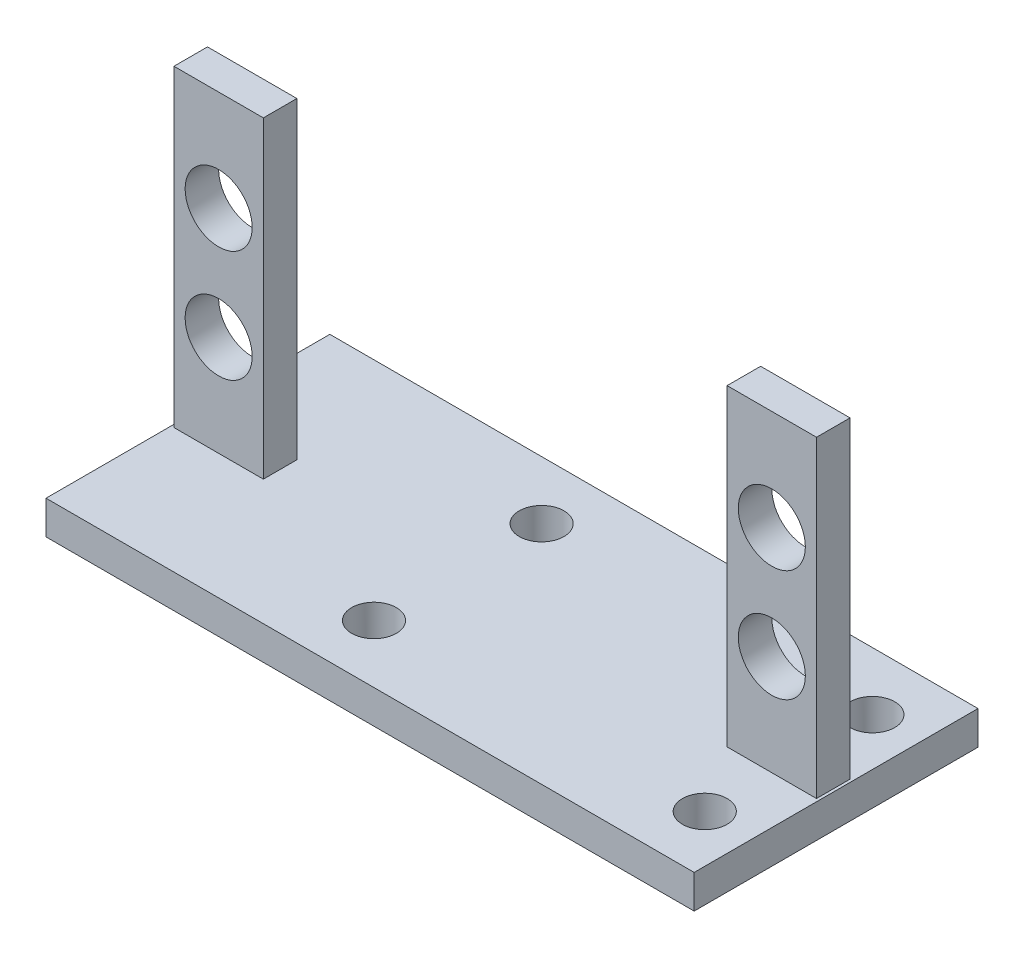
ISO-10303-21;
HEADER;
FILE_DESCRIPTION(('STEP AP214'),'2;1');
FILE_NAME('part.step','',(''),(''),'','','');
FILE_SCHEMA(('AUTOMOTIVE_DESIGN { 1 0 10303 214 1 1 1 1 }'));
ENDSEC;
DATA;
#1=APPLICATION_CONTEXT('core data for automotive mechanical design processes');
#2=APPLICATION_PROTOCOL_DEFINITION('international standard','automotive_design',2000,#1);
#3=PRODUCT_CONTEXT('',#1,'mechanical');
#4=PRODUCT('Part','Part','',(#3));
#5=PRODUCT_RELATED_PRODUCT_CATEGORY('part','',(#4));
#6=PRODUCT_DEFINITION_FORMATION('','',#4);
#7=PRODUCT_DEFINITION_CONTEXT('part definition',#1,'design');
#8=PRODUCT_DEFINITION('design','',#6,#7);
#9=PRODUCT_DEFINITION_SHAPE('','',#8);
#10=(LENGTH_UNIT() NAMED_UNIT(*) SI_UNIT(.MILLI.,.METRE.));
#11=(NAMED_UNIT(*) PLANE_ANGLE_UNIT() SI_UNIT($,.RADIAN.));
#12=(NAMED_UNIT(*) SI_UNIT($,.STERADIAN.) SOLID_ANGLE_UNIT());
#13=UNCERTAINTY_MEASURE_WITH_UNIT(LENGTH_MEASURE(1.E-05),#10,'distance_accuracy_value','');
#14=(GEOMETRIC_REPRESENTATION_CONTEXT(3) GLOBAL_UNCERTAINTY_ASSIGNED_CONTEXT((#13)) GLOBAL_UNIT_ASSIGNED_CONTEXT((#10,
#11,#12)) REPRESENTATION_CONTEXT('',''));
#15=CARTESIAN_POINT('',(0.,0.,0.));
#16=DIRECTION('',(0.,0.,1.));
#17=DIRECTION('',(1.,0.,0.));
#18=AXIS2_PLACEMENT_3D('',#15,#16,#17);
#19=CARTESIAN_POINT('',(-29.,3.,-12.7));
#20=DIRECTION('',(0.,0.,1.));
#21=DIRECTION('',(1.,0.,0.));
#22=AXIS2_PLACEMENT_3D('',#19,#20,#21);
#23=PLANE('',#22);
#24=DIRECTION('',(0.,-1.,0.));
#25=VECTOR('',#24,1.);
#26=CARTESIAN_POINT('',(-29.,3.,-12.7));
#27=LINE('',#26,#25);
#28=CARTESIAN_POINT('',(-29.,3.,-12.7));
#29=VERTEX_POINT('',#28);
#30=CARTESIAN_POINT('',(-29.,0.,-12.7));
#31=VERTEX_POINT('',#30);
#32=EDGE_CURVE('E48',#29,#31,#27,.T.);
#33=ORIENTED_EDGE('',*,*,#32,.F.);
#34=DIRECTION('',(-1.,0.,0.));
#35=VECTOR('',#34,1.);
#36=CARTESIAN_POINT('',(-29.,3.,-12.7));
#37=LINE('',#36,#35);
#38=CARTESIAN_POINT('',(29.,3.,-12.7));
#39=VERTEX_POINT('',#38);
#40=EDGE_CURVE('E208',#39,#29,#37,.T.);
#41=ORIENTED_EDGE('',*,*,#40,.F.);
#42=DIRECTION('',(0.,-1.,0.));
#43=VECTOR('',#42,1.);
#44=CARTESIAN_POINT('',(29.,3.,-12.7));
#45=LINE('',#44,#43);
#46=CARTESIAN_POINT('',(29.,0.,-12.7));
#47=VERTEX_POINT('',#46);
#48=EDGE_CURVE('E11',#39,#47,#45,.T.);
#49=ORIENTED_EDGE('',*,*,#48,.T.);
#50=DIRECTION('',(-1.,0.,0.));
#51=VECTOR('',#50,1.);
#52=CARTESIAN_POINT('',(-29.,0.,-12.7));
#53=LINE('',#52,#51);
#54=EDGE_CURVE('E222',#47,#31,#53,.T.);
#55=ORIENTED_EDGE('',*,*,#54,.T.);
#56=EDGE_LOOP('',(#33,#41,#49,#55));
#57=FACE_BOUND('',#56,.T.);
#58=ADVANCED_FACE('F38',(#57),#23,.F.);
#59=CARTESIAN_POINT('',(0.,3.,0.));
#60=DIRECTION('',(0.,1.,0.));
#61=DIRECTION('',(0.,0.,1.));
#62=AXIS2_PLACEMENT_3D('',#59,#60,#61);
#63=PLANE('',#62);
#64=ORIENTED_EDGE('',*,*,#40,.T.);
#65=DIRECTION('',(0.,0.,1.));
#66=VECTOR('',#65,1.);
#67=CARTESIAN_POINT('',(-29.,3.,-12.7));
#68=LINE('',#67,#66);
#69=CARTESIAN_POINT('',(-29.,3.,12.7));
#70=VERTEX_POINT('',#69);
#71=EDGE_CURVE('E212',#29,#70,#68,.T.);
#72=ORIENTED_EDGE('',*,*,#71,.T.);
#73=DIRECTION('',(1.,0.,0.));
#74=VECTOR('',#73,1.);
#75=CARTESIAN_POINT('',(-29.,3.,12.7));
#76=LINE('',#75,#74);
#77=CARTESIAN_POINT('',(29.,3.,12.7));
#78=VERTEX_POINT('',#77);
#79=EDGE_CURVE('E215',#70,#78,#76,.T.);
#80=ORIENTED_EDGE('',*,*,#79,.T.);
#81=DIRECTION('',(0.,0.,-1.));
#82=VECTOR('',#81,1.);
#83=CARTESIAN_POINT('',(29.,3.,-12.7));
#84=LINE('',#83,#82);
#85=EDGE_CURVE('E204',#78,#39,#84,.T.);
#86=ORIENTED_EDGE('',*,*,#85,.T.);
#87=EDGE_LOOP('',(#64,#72,#80,#86));
#88=FACE_BOUND('',#87,.T.);
#89=CARTESIAN_POINT('',(-4.85,3.,7.5));
#90=DIRECTION('',(0.,1.,0.));
#91=DIRECTION('',(0.,0.,-1.));
#92=AXIS2_PLACEMENT_3D('',#89,#90,#91);
#93=CIRCLE('',#92,2.);
#94=CARTESIAN_POINT('',(-4.85,3.,5.5));
#95=VERTEX_POINT('',#94);
#96=EDGE_CURVE('E389',#95,#95,#93,.T.);
#97=ORIENTED_EDGE('',*,*,#96,.F.);
#98=EDGE_LOOP('',(#97));
#99=FACE_BOUND('',#98,.T.);
#100=CARTESIAN_POINT('',(24.75,3.,-7.5));
#101=DIRECTION('',(0.,1.,0.));
#102=DIRECTION('',(0.,0.,-1.));
#103=AXIS2_PLACEMENT_3D('',#100,#101,#102);
#104=CIRCLE('',#103,2.);
#105=CARTESIAN_POINT('',(24.75,3.,-9.5));
#106=VERTEX_POINT('',#105);
#107=EDGE_CURVE('E393',#106,#106,#104,.T.);
#108=ORIENTED_EDGE('',*,*,#107,.F.);
#109=EDGE_LOOP('',(#108));
#110=FACE_BOUND('',#109,.T.);
#111=CARTESIAN_POINT('',(24.75,3.,7.5));
#112=DIRECTION('',(0.,1.,0.));
#113=DIRECTION('',(0.,0.,1.));
#114=AXIS2_PLACEMENT_3D('',#111,#112,#113);
#115=CIRCLE('',#114,2.);
#116=CARTESIAN_POINT('',(24.75,3.,9.5));
#117=VERTEX_POINT('',#116);
#118=EDGE_CURVE('E397',#117,#117,#115,.T.);
#119=ORIENTED_EDGE('',*,*,#118,.F.);
#120=EDGE_LOOP('',(#119));
#121=FACE_BOUND('',#120,.T.);
#122=CARTESIAN_POINT('',(-4.85,3.,-7.5));
#123=DIRECTION('',(0.,1.,0.));
#124=DIRECTION('',(0.,0.,1.));
#125=AXIS2_PLACEMENT_3D('',#122,#123,#124);
#126=CIRCLE('',#125,2.);
#127=CARTESIAN_POINT('',(-4.85,3.,-5.5));
#128=VERTEX_POINT('',#127);
#129=EDGE_CURVE('E265',#128,#128,#126,.T.);
#130=ORIENTED_EDGE('',*,*,#129,.F.);
#131=EDGE_LOOP('',(#130));
#132=FACE_BOUND('',#131,.T.);
#133=DIRECTION('',(-1.,0.,0.));
#134=VECTOR('',#133,1.);
#135=CARTESIAN_POINT('',(-28.75,3.,-1.5));
#136=LINE('',#135,#134);
#137=CARTESIAN_POINT('',(-20.75,3.,-1.5));
#138=VERTEX_POINT('',#137);
#139=CARTESIAN_POINT('',(-28.75,3.,-1.5));
#140=VERTEX_POINT('',#139);
#141=EDGE_CURVE('E164',#138,#140,#136,.T.);
#142=ORIENTED_EDGE('',*,*,#141,.F.);
#143=DIRECTION('',(0.,0.,-1.));
#144=VECTOR('',#143,1.);
#145=CARTESIAN_POINT('',(-20.75,3.,-1.5));
#146=LINE('',#145,#144);
#147=CARTESIAN_POINT('',(-20.75,3.,1.5));
#148=VERTEX_POINT('',#147);
#149=EDGE_CURVE('E159',#148,#138,#146,.T.);
#150=ORIENTED_EDGE('',*,*,#149,.F.);
#151=DIRECTION('',(1.,0.,0.));
#152=VECTOR('',#151,1.);
#153=CARTESIAN_POINT('',(-20.75,3.,1.5));
#154=LINE('',#153,#152);
#155=CARTESIAN_POINT('',(-28.75,3.,1.5));
#156=VERTEX_POINT('',#155);
#157=EDGE_CURVE('E174',#156,#148,#154,.T.);
#158=ORIENTED_EDGE('',*,*,#157,.F.);
#159=DIRECTION('',(0.,0.,1.));
#160=VECTOR('',#159,1.);
#161=CARTESIAN_POINT('',(-28.75,3.,1.5));
#162=LINE('',#161,#160);
#163=EDGE_CURVE('E186',#140,#156,#162,.T.);
#164=ORIENTED_EDGE('',*,*,#163,.F.);
#165=EDGE_LOOP('',(#142,#150,#158,#164));
#166=FACE_BOUND('',#165,.T.);
#167=DIRECTION('',(0.,0.,-1.));
#168=VECTOR('',#167,1.);
#169=CARTESIAN_POINT('',(28.75,3.,1.5));
#170=LINE('',#169,#168);
#171=CARTESIAN_POINT('',(28.75,3.,1.5));
#172=VERTEX_POINT('',#171);
#173=CARTESIAN_POINT('',(28.75,3.,-1.5));
#174=VERTEX_POINT('',#173);
#175=EDGE_CURVE('E404',#172,#174,#170,.T.);
#176=ORIENTED_EDGE('',*,*,#175,.F.);
#177=DIRECTION('',(1.,0.,0.));
#178=VECTOR('',#177,1.);
#179=CARTESIAN_POINT('',(20.75,3.,1.5));
#180=LINE('',#179,#178);
#181=CARTESIAN_POINT('',(20.75,3.,1.5));
#182=VERTEX_POINT('',#181);
#183=EDGE_CURVE('E156',#182,#172,#180,.T.);
#184=ORIENTED_EDGE('',*,*,#183,.F.);
#185=DIRECTION('',(0.,0.,1.));
#186=VECTOR('',#185,1.);
#187=CARTESIAN_POINT('',(20.75,3.,-1.5));
#188=LINE('',#187,#186);
#189=CARTESIAN_POINT('',(20.75,3.,-1.5));
#190=VERTEX_POINT('',#189);
#191=EDGE_CURVE('E152',#190,#182,#188,.T.);
#192=ORIENTED_EDGE('',*,*,#191,.F.);
#193=DIRECTION('',(-1.,0.,0.));
#194=VECTOR('',#193,1.);
#195=CARTESIAN_POINT('',(28.75,3.,-1.5));
#196=LINE('',#195,#194);
#197=EDGE_CURVE('E406',#174,#190,#196,.T.);
#198=ORIENTED_EDGE('',*,*,#197,.F.);
#199=EDGE_LOOP('',(#176,#184,#192,#198));
#200=FACE_BOUND('',#199,.T.);
#201=ADVANCED_FACE('F294',(#88,#99,#110,#121,#132,#166,#200),#63,.T.);
#202=CARTESIAN_POINT('',(29.,3.,-12.7));
#203=DIRECTION('',(-1.,0.,0.));
#204=DIRECTION('',(0.,0.,1.));
#205=AXIS2_PLACEMENT_3D('',#202,#203,#204);
#206=PLANE('',#205);
#207=DIRECTION('',(0.,0.,-1.));
#208=VECTOR('',#207,1.);
#209=CARTESIAN_POINT('',(29.,0.,-12.7));
#210=LINE('',#209,#208);
#211=CARTESIAN_POINT('',(29.,0.,12.7));
#212=VERTEX_POINT('',#211);
#213=EDGE_CURVE('E203',#212,#47,#210,.T.);
#214=ORIENTED_EDGE('',*,*,#213,.T.);
#215=ORIENTED_EDGE('',*,*,#48,.F.);
#216=ORIENTED_EDGE('',*,*,#85,.F.);
#217=DIRECTION('',(0.,-1.,0.));
#218=VECTOR('',#217,1.);
#219=CARTESIAN_POINT('',(29.,3.,12.7));
#220=LINE('',#219,#218);
#221=EDGE_CURVE('E218',#78,#212,#220,.T.);
#222=ORIENTED_EDGE('',*,*,#221,.T.);
#223=EDGE_LOOP('',(#214,#215,#216,#222));
#224=FACE_BOUND('',#223,.T.);
#225=ADVANCED_FACE('F40',(#224),#206,.F.);
#226=CARTESIAN_POINT('',(-29.,3.,-12.7));
#227=DIRECTION('',(1.,0.,0.));
#228=DIRECTION('',(0.,0.,-1.));
#229=AXIS2_PLACEMENT_3D('',#226,#227,#228);
#230=PLANE('',#229);
#231=DIRECTION('',(0.,0.,1.));
#232=VECTOR('',#231,1.);
#233=CARTESIAN_POINT('',(-29.,0.,-12.7));
#234=LINE('',#233,#232);
#235=CARTESIAN_POINT('',(-29.,0.,12.7));
#236=VERTEX_POINT('',#235);
#237=EDGE_CURVE('E225',#31,#236,#234,.T.);
#238=ORIENTED_EDGE('',*,*,#237,.T.);
#239=DIRECTION('',(0.,-1.,0.));
#240=VECTOR('',#239,1.);
#241=CARTESIAN_POINT('',(-29.,3.,12.7));
#242=LINE('',#241,#240);
#243=EDGE_CURVE('E233',#70,#236,#242,.T.);
#244=ORIENTED_EDGE('',*,*,#243,.F.);
#245=ORIENTED_EDGE('',*,*,#71,.F.);
#246=ORIENTED_EDGE('',*,*,#32,.T.);
#247=EDGE_LOOP('',(#238,#244,#245,#246));
#248=FACE_BOUND('',#247,.T.);
#249=ADVANCED_FACE('F303',(#248),#230,.F.);
#250=CARTESIAN_POINT('',(-29.,3.,12.7));
#251=DIRECTION('',(0.,0.,-1.));
#252=DIRECTION('',(-1.,0.,0.));
#253=AXIS2_PLACEMENT_3D('',#250,#251,#252);
#254=PLANE('',#253);
#255=DIRECTION('',(1.,0.,0.));
#256=VECTOR('',#255,1.);
#257=CARTESIAN_POINT('',(-29.,0.,12.7));
#258=LINE('',#257,#256);
#259=EDGE_CURVE('E209',#236,#212,#258,.T.);
#260=ORIENTED_EDGE('',*,*,#259,.T.);
#261=ORIENTED_EDGE('',*,*,#221,.F.);
#262=ORIENTED_EDGE('',*,*,#79,.F.);
#263=ORIENTED_EDGE('',*,*,#243,.T.);
#264=EDGE_LOOP('',(#260,#261,#262,#263));
#265=FACE_BOUND('',#264,.T.);
#266=ADVANCED_FACE('F306',(#265),#254,.F.);
#267=CARTESIAN_POINT('',(0.,0.,0.));
#268=DIRECTION('',(0.,1.,0.));
#269=DIRECTION('',(0.,0.,1.));
#270=AXIS2_PLACEMENT_3D('',#267,#268,#269);
#271=PLANE('',#270);
#272=CARTESIAN_POINT('',(-4.85,0.,7.5));
#273=DIRECTION('',(0.,1.,0.));
#274=DIRECTION('',(0.,0.,1.));
#275=AXIS2_PLACEMENT_3D('',#272,#273,#274);
#276=CIRCLE('',#275,2.);
#277=CARTESIAN_POINT('',(-4.85,0.,9.5));
#278=VERTEX_POINT('',#277);
#279=EDGE_CURVE('E42',#278,#278,#276,.T.);
#280=ORIENTED_EDGE('',*,*,#279,.T.);
#281=EDGE_LOOP('',(#280));
#282=FACE_BOUND('',#281,.T.);
#283=CARTESIAN_POINT('',(24.75,0.,-7.5));
#284=DIRECTION('',(0.,1.,0.));
#285=DIRECTION('',(0.,0.,1.));
#286=AXIS2_PLACEMENT_3D('',#283,#284,#285);
#287=CIRCLE('',#286,2.);
#288=CARTESIAN_POINT('',(24.75,0.,-5.5));
#289=VERTEX_POINT('',#288);
#290=EDGE_CURVE('E268',#289,#289,#287,.T.);
#291=ORIENTED_EDGE('',*,*,#290,.T.);
#292=EDGE_LOOP('',(#291));
#293=FACE_BOUND('',#292,.T.);
#294=CARTESIAN_POINT('',(24.75,0.,7.5));
#295=DIRECTION('',(0.,1.,0.));
#296=DIRECTION('',(0.,0.,1.));
#297=AXIS2_PLACEMENT_3D('',#294,#295,#296);
#298=CIRCLE('',#297,2.);
#299=CARTESIAN_POINT('',(24.75,0.,9.5));
#300=VERTEX_POINT('',#299);
#301=EDGE_CURVE('E264',#300,#300,#298,.T.);
#302=ORIENTED_EDGE('',*,*,#301,.T.);
#303=EDGE_LOOP('',(#302));
#304=FACE_BOUND('',#303,.T.);
#305=CARTESIAN_POINT('',(-4.85,0.,-7.5));
#306=DIRECTION('',(0.,1.,0.));
#307=DIRECTION('',(0.,0.,1.));
#308=AXIS2_PLACEMENT_3D('',#305,#306,#307);
#309=CIRCLE('',#308,2.);
#310=CARTESIAN_POINT('',(-4.85,0.,-5.5));
#311=VERTEX_POINT('',#310);
#312=EDGE_CURVE('E260',#311,#311,#309,.T.);
#313=ORIENTED_EDGE('',*,*,#312,.T.);
#314=EDGE_LOOP('',(#313));
#315=FACE_BOUND('',#314,.T.);
#316=ORIENTED_EDGE('',*,*,#213,.F.);
#317=ORIENTED_EDGE('',*,*,#259,.F.);
#318=ORIENTED_EDGE('',*,*,#237,.F.);
#319=ORIENTED_EDGE('',*,*,#54,.F.);
#320=EDGE_LOOP('',(#316,#317,#318,#319));
#321=FACE_BOUND('',#320,.T.);
#322=ADVANCED_FACE('F277',(#282,#293,#304,#315,#321),#271,.F.);
#323=CARTESIAN_POINT('',(-20.75,31.,-1.5));
#324=DIRECTION('',(-1.,0.,0.));
#325=DIRECTION('',(0.,0.,1.));
#326=AXIS2_PLACEMENT_3D('',#323,#324,#325);
#327=PLANE('',#326);
#328=ORIENTED_EDGE('',*,*,#149,.T.);
#329=DIRECTION('',(0.,-1.,0.));
#330=VECTOR('',#329,1.);
#331=CARTESIAN_POINT('',(-20.75,31.,-1.5));
#332=LINE('',#331,#330);
#333=CARTESIAN_POINT('',(-20.75,31.,-1.5));
#334=VERTEX_POINT('',#333);
#335=EDGE_CURVE('E200',#334,#138,#332,.T.);
#336=ORIENTED_EDGE('',*,*,#335,.F.);
#337=DIRECTION('',(0.,0.,-1.));
#338=VECTOR('',#337,1.);
#339=CARTESIAN_POINT('',(-20.75,31.,-1.5));
#340=LINE('',#339,#338);
#341=CARTESIAN_POINT('',(-20.75,31.,1.5));
#342=VERTEX_POINT('',#341);
#343=EDGE_CURVE('E169',#342,#334,#340,.T.);
#344=ORIENTED_EDGE('',*,*,#343,.F.);
#345=DIRECTION('',(0.,-1.,0.));
#346=VECTOR('',#345,1.);
#347=CARTESIAN_POINT('',(-20.75,31.,1.5));
#348=LINE('',#347,#346);
#349=EDGE_CURVE('E182',#342,#148,#348,.T.);
#350=ORIENTED_EDGE('',*,*,#349,.T.);
#351=EDGE_LOOP('',(#328,#336,#344,#350));
#352=FACE_BOUND('',#351,.T.);
#353=ADVANCED_FACE('F312',(#352),#327,.F.);
#354=CARTESIAN_POINT('',(-28.75,31.,-1.5));
#355=DIRECTION('',(0.,0.,1.));
#356=DIRECTION('',(1.,0.,0.));
#357=AXIS2_PLACEMENT_3D('',#354,#355,#356);
#358=PLANE('',#357);
#359=CARTESIAN_POINT('',(-24.75,22.,-1.5));
#360=DIRECTION('',(0.,0.,1.));
#361=DIRECTION('',(1.,0.,0.));
#362=AXIS2_PLACEMENT_3D('',#359,#360,#361);
#363=CIRCLE('',#362,3.);
#364=CARTESIAN_POINT('',(-21.75,22.,-1.5));
#365=VERTEX_POINT('',#364);
#366=EDGE_CURVE('E259',#365,#365,#363,.T.);
#367=ORIENTED_EDGE('',*,*,#366,.T.);
#368=EDGE_LOOP('',(#367));
#369=FACE_BOUND('',#368,.T.);
#370=CARTESIAN_POINT('',(-24.75,12.,-1.5));
#371=DIRECTION('',(0.,0.,1.));
#372=DIRECTION('',(1.,0.,0.));
#373=AXIS2_PLACEMENT_3D('',#370,#371,#372);
#374=CIRCLE('',#373,3.);
#375=CARTESIAN_POINT('',(-21.75,12.,-1.5));
#376=VERTEX_POINT('',#375);
#377=EDGE_CURVE('E254',#376,#376,#374,.T.);
#378=ORIENTED_EDGE('',*,*,#377,.T.);
#379=EDGE_LOOP('',(#378));
#380=FACE_BOUND('',#379,.T.);
#381=ORIENTED_EDGE('',*,*,#141,.T.);
#382=DIRECTION('',(0.,-1.,0.));
#383=VECTOR('',#382,1.);
#384=CARTESIAN_POINT('',(-28.75,31.,-1.5));
#385=LINE('',#384,#383);
#386=CARTESIAN_POINT('',(-28.75,31.,-1.5));
#387=VERTEX_POINT('',#386);
#388=EDGE_CURVE('E196',#387,#140,#385,.T.);
#389=ORIENTED_EDGE('',*,*,#388,.F.);
#390=DIRECTION('',(-1.,0.,0.));
#391=VECTOR('',#390,1.);
#392=CARTESIAN_POINT('',(-28.75,31.,-1.5));
#393=LINE('',#392,#391);
#394=EDGE_CURVE('E173',#334,#387,#393,.T.);
#395=ORIENTED_EDGE('',*,*,#394,.F.);
#396=ORIENTED_EDGE('',*,*,#335,.T.);
#397=EDGE_LOOP('',(#381,#389,#395,#396));
#398=FACE_BOUND('',#397,.T.);
#399=ADVANCED_FACE('F316',(#369,#380,#398),#358,.F.);
#400=CARTESIAN_POINT('',(-28.75,31.,1.5));
#401=DIRECTION('',(1.,0.,0.));
#402=DIRECTION('',(0.,0.,-1.));
#403=AXIS2_PLACEMENT_3D('',#400,#401,#402);
#404=PLANE('',#403);
#405=ORIENTED_EDGE('',*,*,#163,.T.);
#406=DIRECTION('',(0.,-1.,0.));
#407=VECTOR('',#406,1.);
#408=CARTESIAN_POINT('',(-28.75,31.,1.5));
#409=LINE('',#408,#407);
#410=CARTESIAN_POINT('',(-28.75,31.,1.5));
#411=VERTEX_POINT('',#410);
#412=EDGE_CURVE('E64',#411,#156,#409,.T.);
#413=ORIENTED_EDGE('',*,*,#412,.F.);
#414=DIRECTION('',(0.,0.,1.));
#415=VECTOR('',#414,1.);
#416=CARTESIAN_POINT('',(-28.75,31.,1.5));
#417=LINE('',#416,#415);
#418=EDGE_CURVE('E177',#387,#411,#417,.T.);
#419=ORIENTED_EDGE('',*,*,#418,.F.);
#420=ORIENTED_EDGE('',*,*,#388,.T.);
#421=EDGE_LOOP('',(#405,#413,#419,#420));
#422=FACE_BOUND('',#421,.T.);
#423=ADVANCED_FACE('F320',(#422),#404,.F.);
#424=CARTESIAN_POINT('',(-20.75,31.,1.5));
#425=DIRECTION('',(0.,0.,-1.));
#426=DIRECTION('',(-1.,0.,0.));
#427=AXIS2_PLACEMENT_3D('',#424,#425,#426);
#428=PLANE('',#427);
#429=CARTESIAN_POINT('',(-24.75,22.,1.5));
#430=DIRECTION('',(0.,0.,-1.));
#431=DIRECTION('',(-1.,0.,0.));
#432=AXIS2_PLACEMENT_3D('',#429,#430,#431);
#433=CIRCLE('',#432,3.);
#434=CARTESIAN_POINT('',(-27.75,22.,1.5));
#435=VERTEX_POINT('',#434);
#436=EDGE_CURVE('E255',#435,#435,#433,.T.);
#437=ORIENTED_EDGE('',*,*,#436,.T.);
#438=EDGE_LOOP('',(#437));
#439=FACE_BOUND('',#438,.T.);
#440=CARTESIAN_POINT('',(-24.75,12.,1.5));
#441=DIRECTION('',(0.,0.,-1.));
#442=DIRECTION('',(-1.,0.,0.));
#443=AXIS2_PLACEMENT_3D('',#440,#441,#442);
#444=CIRCLE('',#443,3.);
#445=CARTESIAN_POINT('',(-27.75,12.,1.5));
#446=VERTEX_POINT('',#445);
#447=EDGE_CURVE('E250',#446,#446,#444,.T.);
#448=ORIENTED_EDGE('',*,*,#447,.T.);
#449=EDGE_LOOP('',(#448));
#450=FACE_BOUND('',#449,.T.);
#451=ORIENTED_EDGE('',*,*,#157,.T.);
#452=ORIENTED_EDGE('',*,*,#349,.F.);
#453=DIRECTION('',(1.,0.,0.));
#454=VECTOR('',#453,1.);
#455=CARTESIAN_POINT('',(-20.75,31.,1.5));
#456=LINE('',#455,#454);
#457=EDGE_CURVE('E180',#411,#342,#456,.T.);
#458=ORIENTED_EDGE('',*,*,#457,.F.);
#459=ORIENTED_EDGE('',*,*,#412,.T.);
#460=EDGE_LOOP('',(#451,#452,#458,#459));
#461=FACE_BOUND('',#460,.T.);
#462=ADVANCED_FACE('F324',(#439,#450,#461),#428,.F.);
#463=CARTESIAN_POINT('',(0.,31.,0.));
#464=DIRECTION('',(0.,-1.,0.));
#465=DIRECTION('',(0.,0.,-1.));
#466=AXIS2_PLACEMENT_3D('',#463,#464,#465);
#467=PLANE('',#466);
#468=ORIENTED_EDGE('',*,*,#343,.T.);
#469=ORIENTED_EDGE('',*,*,#394,.T.);
#470=ORIENTED_EDGE('',*,*,#418,.T.);
#471=ORIENTED_EDGE('',*,*,#457,.T.);
#472=EDGE_LOOP('',(#468,#469,#470,#471));
#473=FACE_BOUND('',#472,.T.);
#474=ADVANCED_FACE('F328',(#473),#467,.F.);
#475=CARTESIAN_POINT('',(20.75,31.,1.5));
#476=DIRECTION('',(0.,0.,-1.));
#477=DIRECTION('',(-1.,0.,0.));
#478=AXIS2_PLACEMENT_3D('',#475,#476,#477);
#479=PLANE('',#478);
#480=CARTESIAN_POINT('',(24.75,12.,1.5));
#481=DIRECTION('',(0.,0.,-1.));
#482=DIRECTION('',(-1.,0.,0.));
#483=AXIS2_PLACEMENT_3D('',#480,#481,#482);
#484=CIRCLE('',#483,3.);
#485=CARTESIAN_POINT('',(21.75,12.,1.5));
#486=VERTEX_POINT('',#485);
#487=EDGE_CURVE('E249',#486,#486,#484,.T.);
#488=ORIENTED_EDGE('',*,*,#487,.T.);
#489=EDGE_LOOP('',(#488));
#490=FACE_BOUND('',#489,.T.);
#491=CARTESIAN_POINT('',(24.75,22.,1.5));
#492=DIRECTION('',(0.,0.,-1.));
#493=DIRECTION('',(-1.,0.,0.));
#494=AXIS2_PLACEMENT_3D('',#491,#492,#493);
#495=CIRCLE('',#494,3.);
#496=CARTESIAN_POINT('',(21.75,22.,1.5));
#497=VERTEX_POINT('',#496);
#498=EDGE_CURVE('E244',#497,#497,#495,.T.);
#499=ORIENTED_EDGE('',*,*,#498,.T.);
#500=EDGE_LOOP('',(#499));
#501=FACE_BOUND('',#500,.T.);
#502=ORIENTED_EDGE('',*,*,#183,.T.);
#503=DIRECTION('',(0.,-1.,0.));
#504=VECTOR('',#503,1.);
#505=CARTESIAN_POINT('',(28.75,31.,1.5));
#506=LINE('',#505,#504);
#507=CARTESIAN_POINT('',(28.75,31.,1.5));
#508=VERTEX_POINT('',#507);
#509=EDGE_CURVE('E135',#508,#172,#506,.T.);
#510=ORIENTED_EDGE('',*,*,#509,.F.);
#511=DIRECTION('',(1.,0.,0.));
#512=VECTOR('',#511,1.);
#513=CARTESIAN_POINT('',(20.75,31.,1.5));
#514=LINE('',#513,#512);
#515=CARTESIAN_POINT('',(20.75,31.,1.5));
#516=VERTEX_POINT('',#515);
#517=EDGE_CURVE('E143',#516,#508,#514,.T.);
#518=ORIENTED_EDGE('',*,*,#517,.F.);
#519=DIRECTION('',(0.,-1.,0.));
#520=VECTOR('',#519,1.);
#521=CARTESIAN_POINT('',(20.75,31.,1.5));
#522=LINE('',#521,#520);
#523=EDGE_CURVE('E417',#516,#182,#522,.T.);
#524=ORIENTED_EDGE('',*,*,#523,.T.);
#525=EDGE_LOOP('',(#502,#510,#518,#524));
#526=FACE_BOUND('',#525,.T.);
#527=ADVANCED_FACE('F154',(#490,#501,#526),#479,.F.);
#528=CARTESIAN_POINT('',(28.75,31.,1.5));
#529=DIRECTION('',(-1.,0.,0.));
#530=DIRECTION('',(0.,0.,1.));
#531=AXIS2_PLACEMENT_3D('',#528,#529,#530);
#532=PLANE('',#531);
#533=ORIENTED_EDGE('',*,*,#175,.T.);
#534=DIRECTION('',(0.,-1.,0.));
#535=VECTOR('',#534,1.);
#536=CARTESIAN_POINT('',(28.75,31.,-1.5));
#537=LINE('',#536,#535);
#538=CARTESIAN_POINT('',(28.75,31.,-1.5));
#539=VERTEX_POINT('',#538);
#540=EDGE_CURVE('E138',#539,#174,#537,.T.);
#541=ORIENTED_EDGE('',*,*,#540,.F.);
#542=DIRECTION('',(0.,0.,-1.));
#543=VECTOR('',#542,1.);
#544=CARTESIAN_POINT('',(28.75,31.,1.5));
#545=LINE('',#544,#543);
#546=EDGE_CURVE('E131',#508,#539,#545,.T.);
#547=ORIENTED_EDGE('',*,*,#546,.F.);
#548=ORIENTED_EDGE('',*,*,#509,.T.);
#549=EDGE_LOOP('',(#533,#541,#547,#548));
#550=FACE_BOUND('',#549,.T.);
#551=ADVANCED_FACE('F133',(#550),#532,.F.);
#552=CARTESIAN_POINT('',(28.75,31.,-1.5));
#553=DIRECTION('',(0.,0.,1.));
#554=DIRECTION('',(1.,0.,0.));
#555=AXIS2_PLACEMENT_3D('',#552,#553,#554);
#556=PLANE('',#555);
#557=CARTESIAN_POINT('',(24.75,12.,-1.5));
#558=DIRECTION('',(0.,0.,1.));
#559=DIRECTION('',(1.,0.,0.));
#560=AXIS2_PLACEMENT_3D('',#557,#558,#559);
#561=CIRCLE('',#560,3.);
#562=CARTESIAN_POINT('',(27.75,12.,-1.5));
#563=VERTEX_POINT('',#562);
#564=EDGE_CURVE('E245',#563,#563,#561,.T.);
#565=ORIENTED_EDGE('',*,*,#564,.T.);
#566=EDGE_LOOP('',(#565));
#567=FACE_BOUND('',#566,.T.);
#568=CARTESIAN_POINT('',(24.75,22.,-1.5));
#569=DIRECTION('',(0.,0.,1.));
#570=DIRECTION('',(1.,0.,0.));
#571=AXIS2_PLACEMENT_3D('',#568,#569,#570);
#572=CIRCLE('',#571,3.);
#573=CARTESIAN_POINT('',(27.75,22.,-1.5));
#574=VERTEX_POINT('',#573);
#575=EDGE_CURVE('E240',#574,#574,#572,.T.);
#576=ORIENTED_EDGE('',*,*,#575,.T.);
#577=EDGE_LOOP('',(#576));
#578=FACE_BOUND('',#577,.T.);
#579=ORIENTED_EDGE('',*,*,#197,.T.);
#580=DIRECTION('',(0.,-1.,0.));
#581=VECTOR('',#580,1.);
#582=CARTESIAN_POINT('',(20.75,31.,-1.5));
#583=LINE('',#582,#581);
#584=CARTESIAN_POINT('',(20.75,31.,-1.5));
#585=VERTEX_POINT('',#584);
#586=EDGE_CURVE('E56',#585,#190,#583,.T.);
#587=ORIENTED_EDGE('',*,*,#586,.F.);
#588=DIRECTION('',(-1.,0.,0.));
#589=VECTOR('',#588,1.);
#590=CARTESIAN_POINT('',(28.75,31.,-1.5));
#591=LINE('',#590,#589);
#592=EDGE_CURVE('E142',#539,#585,#591,.T.);
#593=ORIENTED_EDGE('',*,*,#592,.F.);
#594=ORIENTED_EDGE('',*,*,#540,.T.);
#595=EDGE_LOOP('',(#579,#587,#593,#594));
#596=FACE_BOUND('',#595,.T.);
#597=ADVANCED_FACE('F338',(#567,#578,#596),#556,.F.);
#598=CARTESIAN_POINT('',(20.75,31.,-1.5));
#599=DIRECTION('',(1.,0.,0.));
#600=DIRECTION('',(0.,0.,-1.));
#601=AXIS2_PLACEMENT_3D('',#598,#599,#600);
#602=PLANE('',#601);
#603=ORIENTED_EDGE('',*,*,#191,.T.);
#604=ORIENTED_EDGE('',*,*,#523,.F.);
#605=DIRECTION('',(0.,0.,1.));
#606=VECTOR('',#605,1.);
#607=CARTESIAN_POINT('',(20.75,31.,-1.5));
#608=LINE('',#607,#606);
#609=EDGE_CURVE('E147',#585,#516,#608,.T.);
#610=ORIENTED_EDGE('',*,*,#609,.F.);
#611=ORIENTED_EDGE('',*,*,#586,.T.);
#612=EDGE_LOOP('',(#603,#604,#610,#611));
#613=FACE_BOUND('',#612,.T.);
#614=ADVANCED_FACE('F341',(#613),#602,.F.);
#615=CARTESIAN_POINT('',(0.,31.,0.));
#616=DIRECTION('',(0.,1.,0.));
#617=DIRECTION('',(0.,0.,1.));
#618=AXIS2_PLACEMENT_3D('',#615,#616,#617);
#619=PLANE('',#618);
#620=ORIENTED_EDGE('',*,*,#517,.T.);
#621=ORIENTED_EDGE('',*,*,#546,.T.);
#622=ORIENTED_EDGE('',*,*,#592,.T.);
#623=ORIENTED_EDGE('',*,*,#609,.T.);
#624=EDGE_LOOP('',(#620,#621,#622,#623));
#625=FACE_BOUND('',#624,.T.);
#626=ADVANCED_FACE('F146',(#625),#619,.T.);
#627=CARTESIAN_POINT('',(24.75,22.,-21.7));
#628=DIRECTION('',(0.,0.,1.));
#629=DIRECTION('',(1.,0.,0.));
#630=AXIS2_PLACEMENT_3D('',#627,#628,#629);
#631=CYLINDRICAL_SURFACE('',#630,3.);
#632=ORIENTED_EDGE('',*,*,#575,.F.);
#633=EDGE_LOOP('',(#632));
#634=FACE_BOUND('',#633,.T.);
#635=ORIENTED_EDGE('',*,*,#498,.F.);
#636=EDGE_LOOP('',(#635));
#637=FACE_BOUND('',#636,.T.);
#638=ADVANCED_FACE('F347',(#634,#637),#631,.F.);
#639=CARTESIAN_POINT('',(24.75,12.,-21.7));
#640=DIRECTION('',(0.,0.,1.));
#641=DIRECTION('',(1.,0.,0.));
#642=AXIS2_PLACEMENT_3D('',#639,#640,#641);
#643=CYLINDRICAL_SURFACE('',#642,3.);
#644=ORIENTED_EDGE('',*,*,#564,.F.);
#645=EDGE_LOOP('',(#644));
#646=FACE_BOUND('',#645,.T.);
#647=ORIENTED_EDGE('',*,*,#487,.F.);
#648=EDGE_LOOP('',(#647));
#649=FACE_BOUND('',#648,.T.);
#650=ADVANCED_FACE('F352',(#646,#649),#643,.F.);
#651=CARTESIAN_POINT('',(-24.75,12.,-21.7));
#652=DIRECTION('',(0.,0.,1.));
#653=DIRECTION('',(1.,0.,0.));
#654=AXIS2_PLACEMENT_3D('',#651,#652,#653);
#655=CYLINDRICAL_SURFACE('',#654,3.);
#656=ORIENTED_EDGE('',*,*,#447,.F.);
#657=EDGE_LOOP('',(#656));
#658=FACE_BOUND('',#657,.T.);
#659=ORIENTED_EDGE('',*,*,#377,.F.);
#660=EDGE_LOOP('',(#659));
#661=FACE_BOUND('',#660,.T.);
#662=ADVANCED_FACE('F348',(#658,#661),#655,.F.);
#663=CARTESIAN_POINT('',(-24.75,22.,-21.7));
#664=DIRECTION('',(0.,0.,1.));
#665=DIRECTION('',(1.,0.,0.));
#666=AXIS2_PLACEMENT_3D('',#663,#664,#665);
#667=CYLINDRICAL_SURFACE('',#666,3.);
#668=ORIENTED_EDGE('',*,*,#436,.F.);
#669=EDGE_LOOP('',(#668));
#670=FACE_BOUND('',#669,.T.);
#671=ORIENTED_EDGE('',*,*,#366,.F.);
#672=EDGE_LOOP('',(#671));
#673=FACE_BOUND('',#672,.T.);
#674=ADVANCED_FACE('F351',(#670,#673),#667,.F.);
#675=CARTESIAN_POINT('',(-4.85,-19.,-7.5));
#676=DIRECTION('',(0.,1.,0.));
#677=DIRECTION('',(0.,0.,1.));
#678=AXIS2_PLACEMENT_3D('',#675,#676,#677);
#679=CYLINDRICAL_SURFACE('',#678,2.);
#680=ORIENTED_EDGE('',*,*,#129,.T.);
#681=EDGE_LOOP('',(#680));
#682=FACE_BOUND('',#681,.T.);
#683=ORIENTED_EDGE('',*,*,#312,.F.);
#684=EDGE_LOOP('',(#683));
#685=FACE_BOUND('',#684,.T.);
#686=ADVANCED_FACE('F359',(#682,#685),#679,.F.);
#687=CARTESIAN_POINT('',(24.75,-19.,7.5));
#688=DIRECTION('',(0.,1.,0.));
#689=DIRECTION('',(0.,0.,1.));
#690=AXIS2_PLACEMENT_3D('',#687,#688,#689);
#691=CYLINDRICAL_SURFACE('',#690,2.);
#692=ORIENTED_EDGE('',*,*,#118,.T.);
#693=EDGE_LOOP('',(#692));
#694=FACE_BOUND('',#693,.T.);
#695=ORIENTED_EDGE('',*,*,#301,.F.);
#696=EDGE_LOOP('',(#695));
#697=FACE_BOUND('',#696,.T.);
#698=ADVANCED_FACE('F288',(#694,#697),#691,.F.);
#699=CARTESIAN_POINT('',(24.75,-19.,-7.5));
#700=DIRECTION('',(0.,1.,0.));
#701=DIRECTION('',(0.,0.,1.));
#702=AXIS2_PLACEMENT_3D('',#699,#700,#701);
#703=CYLINDRICAL_SURFACE('',#702,2.);
#704=ORIENTED_EDGE('',*,*,#107,.T.);
#705=EDGE_LOOP('',(#704));
#706=FACE_BOUND('',#705,.T.);
#707=ORIENTED_EDGE('',*,*,#290,.F.);
#708=EDGE_LOOP('',(#707));
#709=FACE_BOUND('',#708,.T.);
#710=ADVANCED_FACE('F281',(#706,#709),#703,.F.);
#711=CARTESIAN_POINT('',(-4.85,-19.,7.5));
#712=DIRECTION('',(0.,1.,0.));
#713=DIRECTION('',(0.,0.,1.));
#714=AXIS2_PLACEMENT_3D('',#711,#712,#713);
#715=CYLINDRICAL_SURFACE('',#714,2.);
#716=ORIENTED_EDGE('',*,*,#96,.T.);
#717=EDGE_LOOP('',(#716));
#718=FACE_BOUND('',#717,.T.);
#719=ORIENTED_EDGE('',*,*,#279,.F.);
#720=EDGE_LOOP('',(#719));
#721=FACE_BOUND('',#720,.T.);
#722=ADVANCED_FACE('F279',(#718,#721),#715,.F.);
#723=CLOSED_SHELL('',(#58,#201,#225,#249,#266,#322,#353,#399,#423,#462,#474,#527,#551,#597,#614,
#626,#638,#650,#662,#674,#686,#698,#710,#722));
#724=MANIFOLD_SOLID_BREP('B2',#723);
#725=ADVANCED_BREP_SHAPE_REPRESENTATION('',(#18,#724),#14);
#726=SHAPE_DEFINITION_REPRESENTATION(#9,#725);
ENDSEC;
END-ISO-10303-21;
